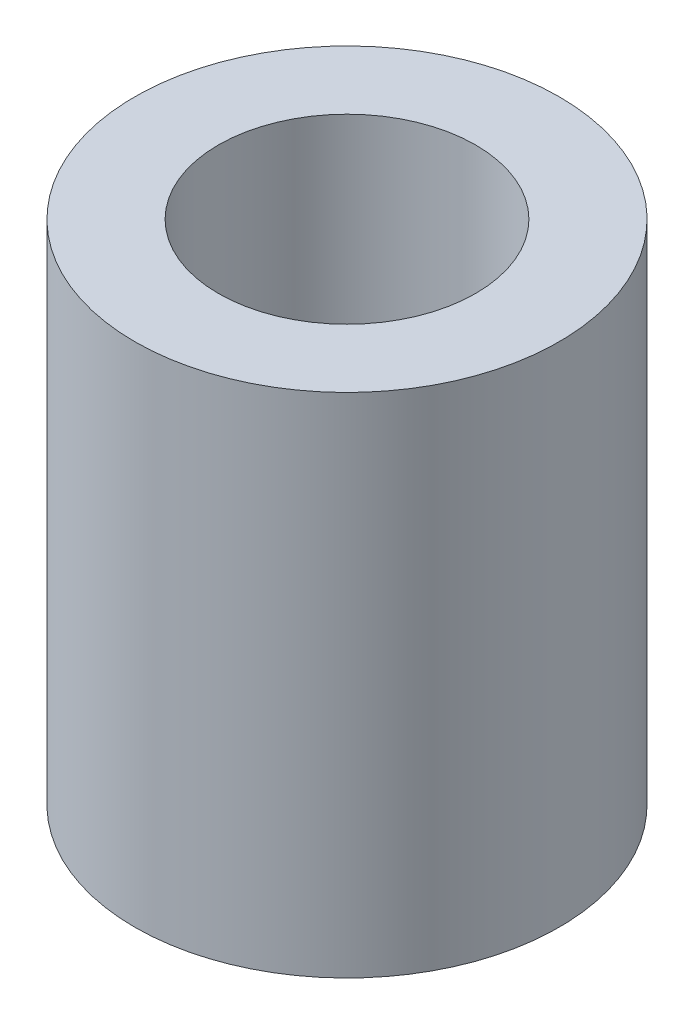
ISO-10303-21;
HEADER;
FILE_DESCRIPTION(('STEP AP214'),'2;1');
FILE_NAME('part.step','',(''),(''),'','','');
FILE_SCHEMA(('AUTOMOTIVE_DESIGN { 1 0 10303 214 1 1 1 1 }'));
ENDSEC;
DATA;
#1=APPLICATION_CONTEXT('core data for automotive mechanical design processes');
#2=APPLICATION_PROTOCOL_DEFINITION('international standard','automotive_design',2000,#1);
#3=PRODUCT_CONTEXT('',#1,'mechanical');
#4=PRODUCT('Part','Part','',(#3));
#5=PRODUCT_RELATED_PRODUCT_CATEGORY('part','',(#4));
#6=PRODUCT_DEFINITION_FORMATION('','',#4);
#7=PRODUCT_DEFINITION_CONTEXT('part definition',#1,'design');
#8=PRODUCT_DEFINITION('design','',#6,#7);
#9=PRODUCT_DEFINITION_SHAPE('','',#8);
#10=(LENGTH_UNIT() NAMED_UNIT(*) SI_UNIT(.MILLI.,.METRE.));
#11=(NAMED_UNIT(*) PLANE_ANGLE_UNIT() SI_UNIT($,.RADIAN.));
#12=(NAMED_UNIT(*) SI_UNIT($,.STERADIAN.) SOLID_ANGLE_UNIT());
#13=UNCERTAINTY_MEASURE_WITH_UNIT(LENGTH_MEASURE(1.E-05),#10,'distance_accuracy_value','');
#14=(GEOMETRIC_REPRESENTATION_CONTEXT(3) GLOBAL_UNCERTAINTY_ASSIGNED_CONTEXT((#13)) GLOBAL_UNIT_ASSIGNED_CONTEXT((#10,
#11,#12)) REPRESENTATION_CONTEXT('',''));
#15=CARTESIAN_POINT('',(0.,0.,0.));
#16=DIRECTION('',(0.,0.,1.));
#17=DIRECTION('',(1.,0.,0.));
#18=AXIS2_PLACEMENT_3D('',#15,#16,#17);
#19=CARTESIAN_POINT('',(0.,9.5,0.));
#20=DIRECTION('',(0.,-1.,0.));
#21=DIRECTION('',(0.,0.,-1.));
#22=AXIS2_PLACEMENT_3D('',#19,#20,#21);
#23=CYLINDRICAL_SURFACE('',#22,3.975);
#24=CARTESIAN_POINT('',(0.,9.5,0.));
#25=DIRECTION('',(0.,1.,0.));
#26=DIRECTION('',(0.,0.,1.));
#27=AXIS2_PLACEMENT_3D('',#24,#25,#26);
#28=CIRCLE('',#27,3.975);
#29=CARTESIAN_POINT('',(0.,9.5,3.975));
#30=VERTEX_POINT('',#29);
#31=EDGE_CURVE('E10',#30,#30,#28,.T.);
#32=ORIENTED_EDGE('',*,*,#31,.F.);
#33=EDGE_LOOP('',(#32));
#34=FACE_BOUND('',#33,.T.);
#35=CARTESIAN_POINT('',(0.,0.,0.));
#36=DIRECTION('',(0.,1.,0.));
#37=DIRECTION('',(0.,0.,1.));
#38=AXIS2_PLACEMENT_3D('',#35,#36,#37);
#39=CIRCLE('',#38,3.975);
#40=CARTESIAN_POINT('',(0.,0.,3.975));
#41=VERTEX_POINT('',#40);
#42=EDGE_CURVE('E33',#41,#41,#39,.T.);
#43=ORIENTED_EDGE('',*,*,#42,.T.);
#44=EDGE_LOOP('',(#43));
#45=FACE_BOUND('',#44,.T.);
#46=ADVANCED_FACE('F30',(#34,#45),#23,.T.);
#47=CARTESIAN_POINT('',(0.,9.5,0.));
#48=DIRECTION('',(0.,1.,0.));
#49=DIRECTION('',(0.,0.,1.));
#50=AXIS2_PLACEMENT_3D('',#47,#48,#49);
#51=PLANE('',#50);
#52=CARTESIAN_POINT('',(0.,9.5,0.));
#53=DIRECTION('',(0.,1.,0.));
#54=DIRECTION('',(0.,0.,1.));
#55=AXIS2_PLACEMENT_3D('',#52,#53,#54);
#56=CIRCLE('',#55,2.41);
#57=CARTESIAN_POINT('',(0.,9.5,2.41));
#58=VERTEX_POINT('',#57);
#59=EDGE_CURVE('E42',#58,#58,#56,.T.);
#60=ORIENTED_EDGE('',*,*,#59,.F.);
#61=EDGE_LOOP('',(#60));
#62=FACE_BOUND('',#61,.T.);
#63=ORIENTED_EDGE('',*,*,#31,.T.);
#64=EDGE_LOOP('',(#63));
#65=FACE_BOUND('',#64,.T.);
#66=ADVANCED_FACE('F57',(#62,#65),#51,.T.);
#67=CARTESIAN_POINT('',(0.,0.,0.));
#68=DIRECTION('',(0.,1.,0.));
#69=DIRECTION('',(0.,0.,1.));
#70=AXIS2_PLACEMENT_3D('',#67,#68,#69);
#71=PLANE('',#70);
#72=CARTESIAN_POINT('',(0.,0.,0.));
#73=DIRECTION('',(0.,1.,0.));
#74=DIRECTION('',(0.,0.,1.));
#75=AXIS2_PLACEMENT_3D('',#72,#73,#74);
#76=CIRCLE('',#75,2.41);
#77=CARTESIAN_POINT('',(0.,0.,2.41));
#78=VERTEX_POINT('',#77);
#79=EDGE_CURVE('E40',#78,#78,#76,.T.);
#80=ORIENTED_EDGE('',*,*,#79,.T.);
#81=EDGE_LOOP('',(#80));
#82=FACE_BOUND('',#81,.T.);
#83=ORIENTED_EDGE('',*,*,#42,.F.);
#84=EDGE_LOOP('',(#83));
#85=FACE_BOUND('',#84,.T.);
#86=ADVANCED_FACE('F48',(#82,#85),#71,.F.);
#87=CARTESIAN_POINT('',(0.,0.,0.));
#88=DIRECTION('',(0.,1.,0.));
#89=DIRECTION('',(0.,0.,1.));
#90=AXIS2_PLACEMENT_3D('',#87,#88,#89);
#91=CYLINDRICAL_SURFACE('',#90,2.41);
#92=ORIENTED_EDGE('',*,*,#79,.F.);
#93=EDGE_LOOP('',(#92));
#94=FACE_BOUND('',#93,.T.);
#95=ORIENTED_EDGE('',*,*,#59,.T.);
#96=EDGE_LOOP('',(#95));
#97=FACE_BOUND('',#96,.T.);
#98=ADVANCED_FACE('F51',(#94,#97),#91,.F.);
#99=CLOSED_SHELL('',(#46,#66,#86,#98));
#100=MANIFOLD_SOLID_BREP('B2',#99);
#101=ADVANCED_BREP_SHAPE_REPRESENTATION('',(#18,#100),#14);
#102=SHAPE_DEFINITION_REPRESENTATION(#9,#101);
ENDSEC;
END-ISO-10303-21;
